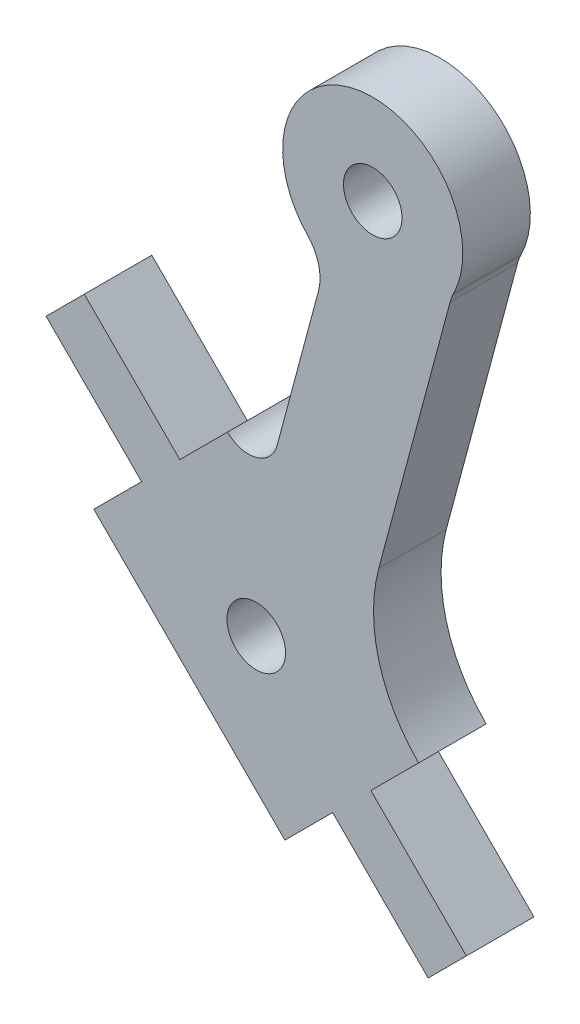
ISO-10303-21;
HEADER;
FILE_DESCRIPTION(('STEP AP214'),'2;1');
FILE_NAME('part.step','',(''),(''),'','','');
FILE_SCHEMA(('AUTOMOTIVE_DESIGN { 1 0 10303 214 1 1 1 1 }'));
ENDSEC;
DATA;
#1=APPLICATION_CONTEXT('core data for automotive mechanical design processes');
#2=APPLICATION_PROTOCOL_DEFINITION('international standard','automotive_design',2000,#1);
#3=PRODUCT_CONTEXT('',#1,'mechanical');
#4=PRODUCT('Part','Part','',(#3));
#5=PRODUCT_RELATED_PRODUCT_CATEGORY('part','',(#4));
#6=PRODUCT_DEFINITION_FORMATION('','',#4);
#7=PRODUCT_DEFINITION_CONTEXT('part definition',#1,'design');
#8=PRODUCT_DEFINITION('design','',#6,#7);
#9=PRODUCT_DEFINITION_SHAPE('','',#8);
#10=(LENGTH_UNIT() NAMED_UNIT(*) SI_UNIT(.MILLI.,.METRE.));
#11=(NAMED_UNIT(*) PLANE_ANGLE_UNIT() SI_UNIT($,.RADIAN.));
#12=(NAMED_UNIT(*) SI_UNIT($,.STERADIAN.) SOLID_ANGLE_UNIT());
#13=UNCERTAINTY_MEASURE_WITH_UNIT(LENGTH_MEASURE(1.E-05),#10,'distance_accuracy_value','');
#14=(GEOMETRIC_REPRESENTATION_CONTEXT(3) GLOBAL_UNCERTAINTY_ASSIGNED_CONTEXT((#13)) GLOBAL_UNIT_ASSIGNED_CONTEXT((#10,
#11,#12)) REPRESENTATION_CONTEXT('',''));
#15=CARTESIAN_POINT('',(0.,0.,0.));
#16=DIRECTION('',(0.,0.,1.));
#17=DIRECTION('',(1.,0.,0.));
#18=AXIS2_PLACEMENT_3D('',#15,#16,#17);
#19=CARTESIAN_POINT('',(59.9340954892964,47.2649253992922,3.));
#20=DIRECTION('',(0.,0.,1.));
#21=DIRECTION('',(1.,0.,0.));
#22=AXIS2_PLACEMENT_3D('',#19,#20,#21);
#23=PLANE('',#22);
#24=CARTESIAN_POINT('',(49.3883299118209,30.6277000118687,3.));
#25=DIRECTION('',(0.,0.,1.));
#26=DIRECTION('',(1.,0.,0.));
#27=AXIS2_PLACEMENT_3D('',#24,#25,#26);
#28=CIRCLE('',#27,1.30000000384585);
#29=CARTESIAN_POINT('',(50.6883299156668,30.6277000118687,3.));
#30=VERTEX_POINT('',#29);
#31=EDGE_CURVE('E194',#30,#30,#28,.T.);
#32=ORIENTED_EDGE('',*,*,#31,.F.);
#33=EDGE_LOOP('',(#32));
#34=FACE_BOUND('',#33,.T.);
#35=CARTESIAN_POINT('',(59.9340954892964,47.2649253992922,3.));
#36=DIRECTION('',(0.,0.,-1.));
#37=DIRECTION('',(1.,0.,0.));
#38=AXIS2_PLACEMENT_3D('',#35,#36,#37);
#39=CIRCLE('',#38,2.00302719153939);
#40=CARTESIAN_POINT('',(57.9994168196844,47.7837089528044,3.));
#41=VERTEX_POINT('',#40);
#42=CARTESIAN_POINT('',(58.1419902390858,48.1596190352445,3.));
#43=VERTEX_POINT('',#42);
#44=EDGE_CURVE('E225',#41,#43,#39,.T.);
#45=ORIENTED_EDGE('',*,*,#44,.T.);
#46=CARTESIAN_POINT('',(54.5632936656663,49.9465843957897,3.));
#47=DIRECTION('',(0.,0.,1.));
#48=DIRECTION('',(1.,0.,0.));
#49=AXIS2_PLACEMENT_3D('',#46,#47,#48);
#50=CIRCLE('',#49,4.00003929535607);
#51=CARTESIAN_POINT('',(51.6693591277227,47.1851613469814,3.));
#52=VERTEX_POINT('',#51);
#53=EDGE_CURVE('E123',#43,#52,#50,.T.);
#54=ORIENTED_EDGE('',*,*,#53,.T.);
#55=CARTESIAN_POINT('',(50.2224063067573,45.8043445908971,3.));
#56=DIRECTION('',(0.,0.,-1.));
#57=DIRECTION('',(1.,0.,0.));
#58=AXIS2_PLACEMENT_3D('',#55,#56,#57);
#59=CIRCLE('',#58,2.00008184332115);
#60=CARTESIAN_POINT('',(52.1543933570869,45.2868956394617,3.));
#61=VERTEX_POINT('',#60);
#62=EDGE_CURVE('E270',#52,#61,#59,.T.);
#63=ORIENTED_EDGE('',*,*,#62,.T.);
#64=DIRECTION('',(-0.258758623392047,-0.965942014212164,0.));
#65=VECTOR('',#64,1.);
#66=CARTESIAN_POINT('',(52.1543933570869,45.2868956394617,3.));
#67=LINE('',#66,#65);
#68=CARTESIAN_POINT('',(50.3176781770945,38.4304657464646,3.));
#69=VERTEX_POINT('',#68);
#70=EDGE_CURVE('E289',#61,#69,#67,.T.);
#71=ORIENTED_EDGE('',*,*,#70,.T.);
#72=CARTESIAN_POINT('',(49.0459421719349,38.7710877379477,3.));
#73=DIRECTION('',(0.,0.,-1.));
#74=DIRECTION('',(1.,0.,0.));
#75=AXIS2_PLACEMENT_3D('',#72,#73,#74);
#76=CIRCLE('',#75,1.31656211699297);
#77=CARTESIAN_POINT('',(48.1150199161977,37.8401099929537,3.));
#78=VERTEX_POINT('',#77);
#79=EDGE_CURVE('E286',#69,#78,#76,.T.);
#80=ORIENTED_EDGE('',*,*,#79,.T.);
#81=DIRECTION('',(-0.707040111425415,-0.707173444662295,0.));
#82=VECTOR('',#81,1.);
#83=CARTESIAN_POINT('',(45.9938699276881,35.7185599991413,3.));
#84=LINE('',#83,#82);
#85=CARTESIAN_POINT('',(45.9938699276881,35.7185599991413,3.));
#86=VERTEX_POINT('',#85);
#87=EDGE_CURVE('E288',#78,#86,#84,.T.);
#88=ORIENTED_EDGE('',*,*,#87,.T.);
#89=DIRECTION('',(-0.707156779603597,0.707056779233938,0.));
#90=VECTOR('',#89,1.);
#91=CARTESIAN_POINT('',(45.9938699276881,35.7185599991413,3.));
#92=LINE('',#91,#90);
#93=CARTESIAN_POINT('',(41.7508699329918,39.9609599832314,3.));
#94=VERTEX_POINT('',#93);
#95=EDGE_CURVE('E291',#86,#94,#92,.T.);
#96=ORIENTED_EDGE('',*,*,#95,.T.);
#97=DIRECTION('',(-0.707035944043609,-0.707177611233814,0.));
#98=VECTOR('',#97,1.);
#99=CARTESIAN_POINT('',(40.0539899407698,38.2637399910098,3.));
#100=LINE('',#99,#98);
#101=CARTESIAN_POINT('',(40.0539899407698,38.2637399910098,3.));
#102=VERTEX_POINT('',#101);
#103=EDGE_CURVE('E297',#94,#102,#100,.T.);
#104=ORIENTED_EDGE('',*,*,#103,.T.);
#105=DIRECTION('',(0.7071567796036,-0.707056779233935,0.));
#106=VECTOR('',#105,1.);
#107=CARTESIAN_POINT('',(44.2968899283951,34.0214399998484,3.));
#108=LINE('',#107,#106);
#109=CARTESIAN_POINT('',(44.2968899283951,34.0214399998484,3.));
#110=VERTEX_POINT('',#109);
#111=EDGE_CURVE('E299',#102,#110,#108,.T.);
#112=ORIENTED_EDGE('',*,*,#111,.T.);
#113=DIRECTION('',(-0.70705677923395,-0.707156779603585,0.));
#114=VECTOR('',#113,1.);
#115=CARTESIAN_POINT('',(44.2968899283951,34.0214399998484,3.));
#116=LINE('',#115,#114);
#117=CARTESIAN_POINT('',(42.1757399328144,31.8999900060357,3.));
#118=VERTEX_POINT('',#117);
#119=EDGE_CURVE('E301',#110,#118,#116,.T.);
#120=ORIENTED_EDGE('',*,*,#119,.T.);
#121=DIRECTION('',(0.707160945978746,-0.707052612244977,0.));
#122=VECTOR('',#121,1.);
#123=CARTESIAN_POINT('',(42.1757399328144,31.8999900060357,3.));
#124=LINE('',#123,#122);
#125=CARTESIAN_POINT('',(50.6616399080648,23.4153900307838,3.));
#126=VERTEX_POINT('',#125);
#127=EDGE_CURVE('E303',#118,#126,#124,.T.);
#128=ORIENTED_EDGE('',*,*,#127,.T.);
#129=DIRECTION('',(0.707073447435398,0.707140113366383,0.));
#130=VECTOR('',#129,1.);
#131=CARTESIAN_POINT('',(52.7827899107166,25.5367400245967,3.));
#132=LINE('',#131,#130);
#133=CARTESIAN_POINT('',(52.7827899107166,25.5367400245967,3.));
#134=VERTEX_POINT('',#133);
#135=EDGE_CURVE('E305',#126,#134,#132,.T.);
#136=ORIENTED_EDGE('',*,*,#135,.T.);
#137=DIRECTION('',(0.707156779603588,-0.707056779233947,0.));
#138=VECTOR('',#137,1.);
#139=CARTESIAN_POINT('',(57.025689898342,21.2944400334352,3.));
#140=LINE('',#139,#138);
#141=CARTESIAN_POINT('',(57.025689898342,21.2944400334352,3.));
#142=VERTEX_POINT('',#141);
#143=EDGE_CURVE('E307',#134,#142,#140,.T.);
#144=ORIENTED_EDGE('',*,*,#143,.T.);
#145=DIRECTION('',(0.707077613810516,0.707135947359507,0.));
#146=VECTOR('',#145,1.);
#147=CARTESIAN_POINT('',(57.025689898342,21.2944400334352,3.));
#148=LINE('',#147,#146);
#149=CARTESIAN_POINT('',(58.7226698976348,22.9915600327281,3.));
#150=VERTEX_POINT('',#149);
#151=EDGE_CURVE('E309',#142,#150,#148,.T.);
#152=ORIENTED_EDGE('',*,*,#151,.T.);
#153=DIRECTION('',(-0.70715677960359,0.707056779233945,0.));
#154=VECTOR('',#153,1.);
#155=CARTESIAN_POINT('',(58.7226698976348,22.9915600327281,3.));
#156=LINE('',#155,#154);
#157=CARTESIAN_POINT('',(54.4796699029387,27.2339600168183,3.));
#158=VERTEX_POINT('',#157);
#159=EDGE_CURVE('E172',#150,#158,#156,.T.);
#160=ORIENTED_EDGE('',*,*,#159,.T.);
#161=DIRECTION('',(0.707073446649667,0.70714011415204,0.));
#162=VECTOR('',#161,1.);
#163=CARTESIAN_POINT('',(54.4796699029387,27.2339600168183,3.));
#164=LINE('',#163,#162);
#165=CARTESIAN_POINT('',(56.6009198985191,29.355410017702,3.));
#166=VERTEX_POINT('',#165);
#167=EDGE_CURVE('E166',#158,#166,#164,.T.);
#168=ORIENTED_EDGE('',*,*,#167,.T.);
#169=CARTESIAN_POINT('',(61.4332448997318,34.1886346537737,3.));
#170=DIRECTION('',(0.,0.,-1.));
#171=DIRECTION('',(1.,0.,0.));
#172=AXIS2_PLACEMENT_3D('',#169,#170,#171);
#173=CIRCLE('',#172,6.83457572202365);
#174=CARTESIAN_POINT('',(54.8314530763904,35.9571849135452,3.));
#175=VERTEX_POINT('',#174);
#176=EDGE_CURVE('E170',#166,#175,#173,.T.);
#177=ORIENTED_EDGE('',*,*,#176,.T.);
#178=DIRECTION('',(0.25874712050464,0.965945095556967,0.));
#179=VECTOR('',#178,1.);
#180=CARTESIAN_POINT('',(57.9994168196844,47.7837089528044,3.));
#181=LINE('',#180,#179);
#182=EDGE_CURVE('E50',#175,#41,#181,.T.);
#183=ORIENTED_EDGE('',*,*,#182,.T.);
#184=EDGE_LOOP('',(#45,#54,#63,#71,#80,#88,#96,#104,#112,#120,#128,#136,#144,#152,#160,#168,
#177,#183));
#185=FACE_BOUND('',#184,.T.);
#186=CARTESIAN_POINT('',(54.5632638715183,49.9465659826852,3.));
#187=DIRECTION('',(0.,0.,1.));
#188=DIRECTION('',(1.,0.,0.));
#189=AXIS2_PLACEMENT_3D('',#186,#187,#188);
#190=CIRCLE('',#189,1.30000000192318);
#191=CARTESIAN_POINT('',(55.8632638734414,49.9465659826852,3.));
#192=VERTEX_POINT('',#191);
#193=EDGE_CURVE('E351',#192,#192,#190,.T.);
#194=ORIENTED_EDGE('',*,*,#193,.F.);
#195=EDGE_LOOP('',(#194));
#196=FACE_BOUND('',#195,.T.);
#197=ADVANCED_FACE('F33',(#34,#185,#196),#23,.T.);
#198=CARTESIAN_POINT('',(59.9340954892964,47.2649253992922,0.));
#199=DIRECTION('',(0.,0.,1.));
#200=DIRECTION('',(1.,0.,0.));
#201=AXIS2_PLACEMENT_3D('',#198,#199,#200);
#202=PLANE('',#201);
#203=CARTESIAN_POINT('',(59.9340954892964,47.2649253992922,0.));
#204=DIRECTION('',(0.,0.,-1.));
#205=DIRECTION('',(1.,0.,0.));
#206=AXIS2_PLACEMENT_3D('',#203,#204,#205);
#207=CIRCLE('',#206,2.00302719153939);
#208=CARTESIAN_POINT('',(57.9994168196844,47.7837089528044,0.));
#209=VERTEX_POINT('',#208);
#210=CARTESIAN_POINT('',(58.1419902390858,48.1596190352445,0.));
#211=VERTEX_POINT('',#210);
#212=EDGE_CURVE('E190',#209,#211,#207,.T.);
#213=ORIENTED_EDGE('',*,*,#212,.F.);
#214=DIRECTION('',(0.25874712050464,0.965945095556967,0.));
#215=VECTOR('',#214,1.);
#216=CARTESIAN_POINT('',(57.9994168196844,47.7837089528044,0.));
#217=LINE('',#216,#215);
#218=CARTESIAN_POINT('',(54.8314530763904,35.9571849135452,0.));
#219=VERTEX_POINT('',#218);
#220=EDGE_CURVE('E115',#219,#209,#217,.T.);
#221=ORIENTED_EDGE('',*,*,#220,.F.);
#222=CARTESIAN_POINT('',(61.4332448997318,34.1886346537737,0.));
#223=DIRECTION('',(0.,0.,-1.));
#224=DIRECTION('',(1.,0.,0.));
#225=AXIS2_PLACEMENT_3D('',#222,#223,#224);
#226=CIRCLE('',#225,6.83457572202365);
#227=CARTESIAN_POINT('',(56.6009198985191,29.355410017702,0.));
#228=VERTEX_POINT('',#227);
#229=EDGE_CURVE('E109',#228,#219,#226,.T.);
#230=ORIENTED_EDGE('',*,*,#229,.F.);
#231=DIRECTION('',(0.707073446649667,0.70714011415204,0.));
#232=VECTOR('',#231,1.);
#233=CARTESIAN_POINT('',(54.4796699029387,27.2339600168183,0.));
#234=LINE('',#233,#232);
#235=CARTESIAN_POINT('',(54.4796699029387,27.2339600168183,0.));
#236=VERTEX_POINT('',#235);
#237=EDGE_CURVE('E180',#236,#228,#234,.T.);
#238=ORIENTED_EDGE('',*,*,#237,.F.);
#239=DIRECTION('',(-0.70715677960359,0.707056779233945,0.));
#240=VECTOR('',#239,1.);
#241=CARTESIAN_POINT('',(58.7226698976348,22.9915600327281,0.));
#242=LINE('',#241,#240);
#243=CARTESIAN_POINT('',(58.7226698976348,22.9915600327281,0.));
#244=VERTEX_POINT('',#243);
#245=EDGE_CURVE('E220',#244,#236,#242,.T.);
#246=ORIENTED_EDGE('',*,*,#245,.F.);
#247=DIRECTION('',(0.707077613810516,0.707135947359507,0.));
#248=VECTOR('',#247,1.);
#249=CARTESIAN_POINT('',(57.025689898342,21.2944400334352,0.));
#250=LINE('',#249,#248);
#251=CARTESIAN_POINT('',(57.025689898342,21.2944400334352,0.));
#252=VERTEX_POINT('',#251);
#253=EDGE_CURVE('E218',#252,#244,#250,.T.);
#254=ORIENTED_EDGE('',*,*,#253,.F.);
#255=DIRECTION('',(0.707156779603588,-0.707056779233947,0.));
#256=VECTOR('',#255,1.);
#257=CARTESIAN_POINT('',(57.025689898342,21.2944400334352,0.));
#258=LINE('',#257,#256);
#259=CARTESIAN_POINT('',(52.7827899107166,25.5367400245967,0.));
#260=VERTEX_POINT('',#259);
#261=EDGE_CURVE('E216',#260,#252,#258,.T.);
#262=ORIENTED_EDGE('',*,*,#261,.F.);
#263=DIRECTION('',(0.707073447435398,0.707140113366383,0.));
#264=VECTOR('',#263,1.);
#265=CARTESIAN_POINT('',(52.7827899107166,25.5367400245967,0.));
#266=LINE('',#265,#264);
#267=CARTESIAN_POINT('',(50.6616399080648,23.4153900307838,0.));
#268=VERTEX_POINT('',#267);
#269=EDGE_CURVE('E214',#268,#260,#266,.T.);
#270=ORIENTED_EDGE('',*,*,#269,.F.);
#271=DIRECTION('',(0.707160945978746,-0.707052612244977,0.));
#272=VECTOR('',#271,1.);
#273=CARTESIAN_POINT('',(42.1757399328144,31.8999900060357,0.));
#274=LINE('',#273,#272);
#275=CARTESIAN_POINT('',(42.1757399328144,31.8999900060357,0.));
#276=VERTEX_POINT('',#275);
#277=EDGE_CURVE('E212',#276,#268,#274,.T.);
#278=ORIENTED_EDGE('',*,*,#277,.F.);
#279=DIRECTION('',(-0.70705677923395,-0.707156779603585,0.));
#280=VECTOR('',#279,1.);
#281=CARTESIAN_POINT('',(44.2968899283951,34.0214399998484,0.));
#282=LINE('',#281,#280);
#283=CARTESIAN_POINT('',(44.2968899283951,34.0214399998484,0.));
#284=VERTEX_POINT('',#283);
#285=EDGE_CURVE('E210',#284,#276,#282,.T.);
#286=ORIENTED_EDGE('',*,*,#285,.F.);
#287=DIRECTION('',(0.7071567796036,-0.707056779233935,0.));
#288=VECTOR('',#287,1.);
#289=CARTESIAN_POINT('',(44.2968899283951,34.0214399998484,0.));
#290=LINE('',#289,#288);
#291=CARTESIAN_POINT('',(40.0539899407698,38.2637399910098,0.));
#292=VERTEX_POINT('',#291);
#293=EDGE_CURVE('E208',#292,#284,#290,.T.);
#294=ORIENTED_EDGE('',*,*,#293,.F.);
#295=DIRECTION('',(-0.707035944043609,-0.707177611233814,0.));
#296=VECTOR('',#295,1.);
#297=CARTESIAN_POINT('',(40.0539899407698,38.2637399910098,0.));
#298=LINE('',#297,#296);
#299=CARTESIAN_POINT('',(41.7508699329918,39.9609599832314,0.));
#300=VERTEX_POINT('',#299);
#301=EDGE_CURVE('E206',#300,#292,#298,.T.);
#302=ORIENTED_EDGE('',*,*,#301,.F.);
#303=DIRECTION('',(-0.707156779603597,0.707056779233938,0.));
#304=VECTOR('',#303,1.);
#305=CARTESIAN_POINT('',(45.9938699276881,35.7185599991413,0.));
#306=LINE('',#305,#304);
#307=CARTESIAN_POINT('',(45.9938699276881,35.7185599991413,0.));
#308=VERTEX_POINT('',#307);
#309=EDGE_CURVE('E204',#308,#300,#306,.T.);
#310=ORIENTED_EDGE('',*,*,#309,.F.);
#311=DIRECTION('',(-0.707040111425415,-0.707173444662295,0.));
#312=VECTOR('',#311,1.);
#313=CARTESIAN_POINT('',(45.9938699276881,35.7185599991413,0.));
#314=LINE('',#313,#312);
#315=CARTESIAN_POINT('',(48.1150199161977,37.8401099929537,0.));
#316=VERTEX_POINT('',#315);
#317=EDGE_CURVE('E202',#316,#308,#314,.T.);
#318=ORIENTED_EDGE('',*,*,#317,.F.);
#319=CARTESIAN_POINT('',(49.0459421719349,38.7710877379477,0.));
#320=DIRECTION('',(0.,0.,-1.));
#321=DIRECTION('',(1.,0.,0.));
#322=AXIS2_PLACEMENT_3D('',#319,#320,#321);
#323=CIRCLE('',#322,1.31656211699297);
#324=CARTESIAN_POINT('',(50.3176781770945,38.4304657464646,0.));
#325=VERTEX_POINT('',#324);
#326=EDGE_CURVE('E200',#325,#316,#323,.T.);
#327=ORIENTED_EDGE('',*,*,#326,.F.);
#328=DIRECTION('',(-0.258758623392047,-0.965942014212164,0.));
#329=VECTOR('',#328,1.);
#330=CARTESIAN_POINT('',(52.1543933570869,45.2868956394617,0.));
#331=LINE('',#330,#329);
#332=CARTESIAN_POINT('',(52.1543933570869,45.2868956394617,0.));
#333=VERTEX_POINT('',#332);
#334=EDGE_CURVE('E198',#333,#325,#331,.T.);
#335=ORIENTED_EDGE('',*,*,#334,.F.);
#336=CARTESIAN_POINT('',(50.2224063067573,45.8043445908971,0.));
#337=DIRECTION('',(0.,0.,-1.));
#338=DIRECTION('',(1.,0.,0.));
#339=AXIS2_PLACEMENT_3D('',#336,#337,#338);
#340=CIRCLE('',#339,2.00008184332115);
#341=CARTESIAN_POINT('',(51.6693591277227,47.1851613469814,0.));
#342=VERTEX_POINT('',#341);
#343=EDGE_CURVE('E196',#342,#333,#340,.T.);
#344=ORIENTED_EDGE('',*,*,#343,.F.);
#345=CARTESIAN_POINT('',(54.5632936656663,49.9465843957897,0.));
#346=DIRECTION('',(0.,0.,1.));
#347=DIRECTION('',(1.,0.,0.));
#348=AXIS2_PLACEMENT_3D('',#345,#346,#347);
#349=CIRCLE('',#348,4.00003929535607);
#350=EDGE_CURVE('E193',#211,#342,#349,.T.);
#351=ORIENTED_EDGE('',*,*,#350,.F.);
#352=EDGE_LOOP('',(#213,#221,#230,#238,#246,#254,#262,#270,#278,#286,#294,#302,#310,#318,#327,
#335,#344,#351));
#353=FACE_BOUND('',#352,.T.);
#354=CARTESIAN_POINT('',(49.3883299118209,30.6277000118687,0.));
#355=DIRECTION('',(0.,0.,1.));
#356=DIRECTION('',(1.,0.,0.));
#357=AXIS2_PLACEMENT_3D('',#354,#355,#356);
#358=CIRCLE('',#357,1.30000000384585);
#359=CARTESIAN_POINT('',(50.6883299156668,30.6277000118687,0.));
#360=VERTEX_POINT('',#359);
#361=EDGE_CURVE('E357',#360,#360,#358,.T.);
#362=ORIENTED_EDGE('',*,*,#361,.T.);
#363=EDGE_LOOP('',(#362));
#364=FACE_BOUND('',#363,.T.);
#365=CARTESIAN_POINT('',(54.5632638715183,49.9465659826852,0.));
#366=DIRECTION('',(0.,0.,1.));
#367=DIRECTION('',(1.,0.,0.));
#368=AXIS2_PLACEMENT_3D('',#365,#366,#367);
#369=CIRCLE('',#368,1.30000000192318);
#370=CARTESIAN_POINT('',(55.8632638734414,49.9465659826852,0.));
#371=VERTEX_POINT('',#370);
#372=EDGE_CURVE('E354',#371,#371,#369,.T.);
#373=ORIENTED_EDGE('',*,*,#372,.T.);
#374=EDGE_LOOP('',(#373));
#375=FACE_BOUND('',#374,.T.);
#376=ADVANCED_FACE('F274',(#353,#364,#375),#202,.F.);
#377=CARTESIAN_POINT('',(59.9340954892964,47.2649253992922,3.));
#378=DIRECTION('',(0.,0.,-1.));
#379=DIRECTION('',(-1.,0.,0.));
#380=AXIS2_PLACEMENT_3D('',#377,#378,#379);
#381=CYLINDRICAL_SURFACE('',#380,2.00302719153939);
#382=ORIENTED_EDGE('',*,*,#212,.T.);
#383=DIRECTION('',(0.,0.,-1.));
#384=VECTOR('',#383,1.);
#385=CARTESIAN_POINT('',(58.1419902390858,48.1596190352445,3.));
#386=LINE('',#385,#384);
#387=EDGE_CURVE('E11',#43,#211,#386,.T.);
#388=ORIENTED_EDGE('',*,*,#387,.F.);
#389=ORIENTED_EDGE('',*,*,#44,.F.);
#390=DIRECTION('',(0.,0.,-1.));
#391=VECTOR('',#390,1.);
#392=CARTESIAN_POINT('',(57.9994168196844,47.7837089528044,3.));
#393=LINE('',#392,#391);
#394=EDGE_CURVE('E186',#41,#209,#393,.T.);
#395=ORIENTED_EDGE('',*,*,#394,.T.);
#396=EDGE_LOOP('',(#382,#388,#389,#395));
#397=FACE_BOUND('',#396,.T.);
#398=ADVANCED_FACE('F35',(#397),#381,.F.);
#399=CARTESIAN_POINT('',(54.5632936656663,49.9465843957897,3.));
#400=DIRECTION('',(0.,0.,-1.));
#401=DIRECTION('',(-1.,0.,0.));
#402=AXIS2_PLACEMENT_3D('',#399,#400,#401);
#403=CYLINDRICAL_SURFACE('',#402,4.00003929535607);
#404=ORIENTED_EDGE('',*,*,#350,.T.);
#405=DIRECTION('',(0.,0.,-1.));
#406=VECTOR('',#405,1.);
#407=CARTESIAN_POINT('',(51.6693591277227,47.1851613469814,3.));
#408=LINE('',#407,#406);
#409=EDGE_CURVE('E42',#52,#342,#408,.T.);
#410=ORIENTED_EDGE('',*,*,#409,.F.);
#411=ORIENTED_EDGE('',*,*,#53,.F.);
#412=ORIENTED_EDGE('',*,*,#387,.T.);
#413=EDGE_LOOP('',(#404,#410,#411,#412));
#414=FACE_BOUND('',#413,.T.);
#415=ADVANCED_FACE('F510',(#414),#403,.T.);
#416=CARTESIAN_POINT('',(50.2224063067573,45.8043445908971,3.));
#417=DIRECTION('',(0.,0.,-1.));
#418=DIRECTION('',(-1.,0.,0.));
#419=AXIS2_PLACEMENT_3D('',#416,#417,#418);
#420=CYLINDRICAL_SURFACE('',#419,2.00008184332115);
#421=ORIENTED_EDGE('',*,*,#343,.T.);
#422=DIRECTION('',(0.,0.,-1.));
#423=VECTOR('',#422,1.);
#424=CARTESIAN_POINT('',(52.1543933570869,45.2868956394617,3.));
#425=LINE('',#424,#423);
#426=EDGE_CURVE('E262',#61,#333,#425,.T.);
#427=ORIENTED_EDGE('',*,*,#426,.F.);
#428=ORIENTED_EDGE('',*,*,#62,.F.);
#429=ORIENTED_EDGE('',*,*,#409,.T.);
#430=EDGE_LOOP('',(#421,#427,#428,#429));
#431=FACE_BOUND('',#430,.T.);
#432=ADVANCED_FACE('F268',(#431),#420,.F.);
#433=CARTESIAN_POINT('',(52.1543933570869,45.2868956394617,3.));
#434=DIRECTION('',(0.965942014212164,-0.258758623392047,0.));
#435=DIRECTION('',(0.258758623392047,0.965942014212164,0.));
#436=AXIS2_PLACEMENT_3D('',#433,#434,#435);
#437=PLANE('',#436);
#438=ORIENTED_EDGE('',*,*,#334,.T.);
#439=DIRECTION('',(0.,0.,-1.));
#440=VECTOR('',#439,1.);
#441=CARTESIAN_POINT('',(50.3176781770945,38.4304657464646,3.));
#442=LINE('',#441,#440);
#443=EDGE_CURVE('E259',#69,#325,#442,.T.);
#444=ORIENTED_EDGE('',*,*,#443,.F.);
#445=ORIENTED_EDGE('',*,*,#70,.F.);
#446=ORIENTED_EDGE('',*,*,#426,.T.);
#447=EDGE_LOOP('',(#438,#444,#445,#446));
#448=FACE_BOUND('',#447,.T.);
#449=ADVANCED_FACE('F280',(#448),#437,.F.);
#450=CARTESIAN_POINT('',(49.0459421719349,38.7710877379477,3.));
#451=DIRECTION('',(0.,0.,-1.));
#452=DIRECTION('',(-1.,0.,0.));
#453=AXIS2_PLACEMENT_3D('',#450,#451,#452);
#454=CYLINDRICAL_SURFACE('',#453,1.31656211699297);
#455=ORIENTED_EDGE('',*,*,#326,.T.);
#456=DIRECTION('',(0.,0.,-1.));
#457=VECTOR('',#456,1.);
#458=CARTESIAN_POINT('',(48.1150199161977,37.8401099929537,3.));
#459=LINE('',#458,#457);
#460=EDGE_CURVE('E256',#78,#316,#459,.T.);
#461=ORIENTED_EDGE('',*,*,#460,.F.);
#462=ORIENTED_EDGE('',*,*,#79,.F.);
#463=ORIENTED_EDGE('',*,*,#443,.T.);
#464=EDGE_LOOP('',(#455,#461,#462,#463));
#465=FACE_BOUND('',#464,.T.);
#466=ADVANCED_FACE('F284',(#465),#454,.F.);
#467=CARTESIAN_POINT('',(45.9938699276881,35.7185599991413,3.));
#468=DIRECTION('',(0.707173444662295,-0.707040111425415,0.));
#469=DIRECTION('',(0.707040111425415,0.707173444662295,0.));
#470=AXIS2_PLACEMENT_3D('',#467,#468,#469);
#471=PLANE('',#470);
#472=ORIENTED_EDGE('',*,*,#317,.T.);
#473=DIRECTION('',(0.,0.,-1.));
#474=VECTOR('',#473,1.);
#475=CARTESIAN_POINT('',(45.9938699276881,35.7185599991413,3.));
#476=LINE('',#475,#474);
#477=EDGE_CURVE('E253',#86,#308,#476,.T.);
#478=ORIENTED_EDGE('',*,*,#477,.F.);
#479=ORIENTED_EDGE('',*,*,#87,.F.);
#480=ORIENTED_EDGE('',*,*,#460,.T.);
#481=EDGE_LOOP('',(#472,#478,#479,#480));
#482=FACE_BOUND('',#481,.T.);
#483=ADVANCED_FACE('F475',(#482),#471,.F.);
#484=CARTESIAN_POINT('',(45.9938699276881,35.7185599991413,3.));
#485=DIRECTION('',(-0.707056779233938,-0.707156779603597,0.));
#486=DIRECTION('',(0.707156779603597,-0.707056779233938,0.));
#487=AXIS2_PLACEMENT_3D('',#484,#485,#486);
#488=PLANE('',#487);
#489=ORIENTED_EDGE('',*,*,#309,.T.);
#490=DIRECTION('',(0.,0.,-1.));
#491=VECTOR('',#490,1.);
#492=CARTESIAN_POINT('',(41.7508699329918,39.9609599832314,3.));
#493=LINE('',#492,#491);
#494=EDGE_CURVE('E250',#94,#300,#493,.T.);
#495=ORIENTED_EDGE('',*,*,#494,.F.);
#496=ORIENTED_EDGE('',*,*,#95,.F.);
#497=ORIENTED_EDGE('',*,*,#477,.T.);
#498=EDGE_LOOP('',(#489,#495,#496,#497));
#499=FACE_BOUND('',#498,.T.);
#500=ADVANCED_FACE('F465',(#499),#488,.F.);
#501=CARTESIAN_POINT('',(40.0539899407698,38.2637399910098,3.));
#502=DIRECTION('',(0.707177611233814,-0.707035944043609,0.));
#503=DIRECTION('',(0.707035944043609,0.707177611233814,0.));
#504=AXIS2_PLACEMENT_3D('',#501,#502,#503);
#505=PLANE('',#504);
#506=ORIENTED_EDGE('',*,*,#301,.T.);
#507=DIRECTION('',(0.,0.,-1.));
#508=VECTOR('',#507,1.);
#509=CARTESIAN_POINT('',(40.0539899407698,38.2637399910098,3.));
#510=LINE('',#509,#508);
#511=EDGE_CURVE('E247',#102,#292,#510,.T.);
#512=ORIENTED_EDGE('',*,*,#511,.F.);
#513=ORIENTED_EDGE('',*,*,#103,.F.);
#514=ORIENTED_EDGE('',*,*,#494,.T.);
#515=EDGE_LOOP('',(#506,#512,#513,#514));
#516=FACE_BOUND('',#515,.T.);
#517=ADVANCED_FACE('F455',(#516),#505,.F.);
#518=CARTESIAN_POINT('',(44.2968899283951,34.0214399998484,3.));
#519=DIRECTION('',(0.707056779233935,0.7071567796036,0.));
#520=DIRECTION('',(-0.7071567796036,0.707056779233935,0.));
#521=AXIS2_PLACEMENT_3D('',#518,#519,#520);
#522=PLANE('',#521);
#523=ORIENTED_EDGE('',*,*,#293,.T.);
#524=DIRECTION('',(0.,0.,-1.));
#525=VECTOR('',#524,1.);
#526=CARTESIAN_POINT('',(44.2968899283951,34.0214399998484,3.));
#527=LINE('',#526,#525);
#528=EDGE_CURVE('E244',#110,#284,#527,.T.);
#529=ORIENTED_EDGE('',*,*,#528,.F.);
#530=ORIENTED_EDGE('',*,*,#111,.F.);
#531=ORIENTED_EDGE('',*,*,#511,.T.);
#532=EDGE_LOOP('',(#523,#529,#530,#531));
#533=FACE_BOUND('',#532,.T.);
#534=ADVANCED_FACE('F445',(#533),#522,.F.);
#535=CARTESIAN_POINT('',(44.2968899283951,34.0214399998484,3.));
#536=DIRECTION('',(0.707156779603585,-0.70705677923395,0.));
#537=DIRECTION('',(0.70705677923395,0.707156779603585,0.));
#538=AXIS2_PLACEMENT_3D('',#535,#536,#537);
#539=PLANE('',#538);
#540=ORIENTED_EDGE('',*,*,#285,.T.);
#541=DIRECTION('',(0.,0.,-1.));
#542=VECTOR('',#541,1.);
#543=CARTESIAN_POINT('',(42.1757399328144,31.8999900060357,3.));
#544=LINE('',#543,#542);
#545=EDGE_CURVE('E241',#118,#276,#544,.T.);
#546=ORIENTED_EDGE('',*,*,#545,.F.);
#547=ORIENTED_EDGE('',*,*,#119,.F.);
#548=ORIENTED_EDGE('',*,*,#528,.T.);
#549=EDGE_LOOP('',(#540,#546,#547,#548));
#550=FACE_BOUND('',#549,.T.);
#551=ADVANCED_FACE('F435',(#550),#539,.F.);
#552=CARTESIAN_POINT('',(42.1757399328144,31.8999900060357,3.));
#553=DIRECTION('',(0.707052612244977,0.707160945978746,0.));
#554=DIRECTION('',(-0.707160945978746,0.707052612244977,0.));
#555=AXIS2_PLACEMENT_3D('',#552,#553,#554);
#556=PLANE('',#555);
#557=ORIENTED_EDGE('',*,*,#277,.T.);
#558=DIRECTION('',(0.,0.,-1.));
#559=VECTOR('',#558,1.);
#560=CARTESIAN_POINT('',(50.6616399080648,23.4153900307838,3.));
#561=LINE('',#560,#559);
#562=EDGE_CURVE('E238',#126,#268,#561,.T.);
#563=ORIENTED_EDGE('',*,*,#562,.F.);
#564=ORIENTED_EDGE('',*,*,#127,.F.);
#565=ORIENTED_EDGE('',*,*,#545,.T.);
#566=EDGE_LOOP('',(#557,#563,#564,#565));
#567=FACE_BOUND('',#566,.T.);
#568=ADVANCED_FACE('F425',(#567),#556,.F.);
#569=CARTESIAN_POINT('',(52.7827899107166,25.5367400245967,3.));
#570=DIRECTION('',(-0.707140113366383,0.707073447435398,0.));
#571=DIRECTION('',(-0.707073447435398,-0.707140113366383,0.));
#572=AXIS2_PLACEMENT_3D('',#569,#570,#571);
#573=PLANE('',#572);
#574=ORIENTED_EDGE('',*,*,#269,.T.);
#575=DIRECTION('',(0.,0.,-1.));
#576=VECTOR('',#575,1.);
#577=CARTESIAN_POINT('',(52.7827899107166,25.5367400245967,3.));
#578=LINE('',#577,#576);
#579=EDGE_CURVE('E235',#134,#260,#578,.T.);
#580=ORIENTED_EDGE('',*,*,#579,.F.);
#581=ORIENTED_EDGE('',*,*,#135,.F.);
#582=ORIENTED_EDGE('',*,*,#562,.T.);
#583=EDGE_LOOP('',(#574,#580,#581,#582));
#584=FACE_BOUND('',#583,.T.);
#585=ADVANCED_FACE('F415',(#584),#573,.F.);
#586=CARTESIAN_POINT('',(57.025689898342,21.2944400334352,3.));
#587=DIRECTION('',(0.707056779233947,0.707156779603588,0.));
#588=DIRECTION('',(-0.707156779603588,0.707056779233947,0.));
#589=AXIS2_PLACEMENT_3D('',#586,#587,#588);
#590=PLANE('',#589);
#591=ORIENTED_EDGE('',*,*,#261,.T.);
#592=DIRECTION('',(0.,0.,-1.));
#593=VECTOR('',#592,1.);
#594=CARTESIAN_POINT('',(57.025689898342,21.2944400334352,3.));
#595=LINE('',#594,#593);
#596=EDGE_CURVE('E232',#142,#252,#595,.T.);
#597=ORIENTED_EDGE('',*,*,#596,.F.);
#598=ORIENTED_EDGE('',*,*,#143,.F.);
#599=ORIENTED_EDGE('',*,*,#579,.T.);
#600=EDGE_LOOP('',(#591,#597,#598,#599));
#601=FACE_BOUND('',#600,.T.);
#602=ADVANCED_FACE('F406',(#601),#590,.F.);
#603=CARTESIAN_POINT('',(57.025689898342,21.2944400334352,3.));
#604=DIRECTION('',(-0.707135947359507,0.707077613810516,0.));
#605=DIRECTION('',(-0.707077613810516,-0.707135947359507,0.));
#606=AXIS2_PLACEMENT_3D('',#603,#604,#605);
#607=PLANE('',#606);
#608=ORIENTED_EDGE('',*,*,#253,.T.);
#609=DIRECTION('',(0.,0.,-1.));
#610=VECTOR('',#609,1.);
#611=CARTESIAN_POINT('',(58.7226698976348,22.9915600327281,3.));
#612=LINE('',#611,#610);
#613=EDGE_CURVE('E229',#150,#244,#612,.T.);
#614=ORIENTED_EDGE('',*,*,#613,.F.);
#615=ORIENTED_EDGE('',*,*,#151,.F.);
#616=ORIENTED_EDGE('',*,*,#596,.T.);
#617=EDGE_LOOP('',(#608,#614,#615,#616));
#618=FACE_BOUND('',#617,.T.);
#619=ADVANCED_FACE('F315',(#618),#607,.F.);
#620=CARTESIAN_POINT('',(58.7226698976348,22.9915600327281,3.));
#621=DIRECTION('',(-0.707056779233945,-0.70715677960359,0.));
#622=DIRECTION('',(0.70715677960359,-0.707056779233945,0.));
#623=AXIS2_PLACEMENT_3D('',#620,#621,#622);
#624=PLANE('',#623);
#625=ORIENTED_EDGE('',*,*,#245,.T.);
#626=DIRECTION('',(0.,0.,-1.));
#627=VECTOR('',#626,1.);
#628=CARTESIAN_POINT('',(54.4796699029387,27.2339600168183,3.));
#629=LINE('',#628,#627);
#630=EDGE_CURVE('E181',#158,#236,#629,.T.);
#631=ORIENTED_EDGE('',*,*,#630,.F.);
#632=ORIENTED_EDGE('',*,*,#159,.F.);
#633=ORIENTED_EDGE('',*,*,#613,.T.);
#634=EDGE_LOOP('',(#625,#631,#632,#633));
#635=FACE_BOUND('',#634,.T.);
#636=ADVANCED_FACE('F319',(#635),#624,.F.);
#637=CARTESIAN_POINT('',(54.4796699029387,27.2339600168183,3.));
#638=DIRECTION('',(-0.70714011415204,0.707073446649667,0.));
#639=DIRECTION('',(-0.707073446649667,-0.70714011415204,0.));
#640=AXIS2_PLACEMENT_3D('',#637,#638,#639);
#641=PLANE('',#640);
#642=ORIENTED_EDGE('',*,*,#237,.T.);
#643=DIRECTION('',(0.,0.,-1.));
#644=VECTOR('',#643,1.);
#645=CARTESIAN_POINT('',(56.6009198985191,29.355410017702,3.));
#646=LINE('',#645,#644);
#647=EDGE_CURVE('E177',#166,#228,#646,.T.);
#648=ORIENTED_EDGE('',*,*,#647,.F.);
#649=ORIENTED_EDGE('',*,*,#167,.F.);
#650=ORIENTED_EDGE('',*,*,#630,.T.);
#651=EDGE_LOOP('',(#642,#648,#649,#650));
#652=FACE_BOUND('',#651,.T.);
#653=ADVANCED_FACE('F178',(#652),#641,.F.);
#654=CARTESIAN_POINT('',(61.4332448997318,34.1886346537737,3.));
#655=DIRECTION('',(0.,0.,-1.));
#656=DIRECTION('',(-1.,0.,0.));
#657=AXIS2_PLACEMENT_3D('',#654,#655,#656);
#658=CYLINDRICAL_SURFACE('',#657,6.83457572202365);
#659=ORIENTED_EDGE('',*,*,#229,.T.);
#660=DIRECTION('',(0.,0.,-1.));
#661=VECTOR('',#660,1.);
#662=CARTESIAN_POINT('',(54.8314530763904,35.9571849135452,3.));
#663=LINE('',#662,#661);
#664=EDGE_CURVE('E182',#175,#219,#663,.T.);
#665=ORIENTED_EDGE('',*,*,#664,.F.);
#666=ORIENTED_EDGE('',*,*,#176,.F.);
#667=ORIENTED_EDGE('',*,*,#647,.T.);
#668=EDGE_LOOP('',(#659,#665,#666,#667));
#669=FACE_BOUND('',#668,.T.);
#670=ADVANCED_FACE('F184',(#669),#658,.F.);
#671=CARTESIAN_POINT('',(57.9994168196844,47.7837089528044,3.));
#672=DIRECTION('',(-0.965945095556967,0.25874712050464,0.));
#673=DIRECTION('',(-0.25874712050464,-0.965945095556967,0.));
#674=AXIS2_PLACEMENT_3D('',#671,#672,#673);
#675=PLANE('',#674);
#676=ORIENTED_EDGE('',*,*,#220,.T.);
#677=ORIENTED_EDGE('',*,*,#394,.F.);
#678=ORIENTED_EDGE('',*,*,#182,.F.);
#679=ORIENTED_EDGE('',*,*,#664,.T.);
#680=EDGE_LOOP('',(#676,#677,#678,#679));
#681=FACE_BOUND('',#680,.T.);
#682=ADVANCED_FACE('F323',(#681),#675,.F.);
#683=CARTESIAN_POINT('',(49.3883299118209,30.6277000118687,3.));
#684=DIRECTION('',(0.,0.,-1.));
#685=DIRECTION('',(-1.,0.,0.));
#686=AXIS2_PLACEMENT_3D('',#683,#684,#685);
#687=CYLINDRICAL_SURFACE('',#686,1.30000000384585);
#688=ORIENTED_EDGE('',*,*,#31,.T.);
#689=EDGE_LOOP('',(#688));
#690=FACE_BOUND('',#689,.T.);
#691=ORIENTED_EDGE('',*,*,#361,.F.);
#692=EDGE_LOOP('',(#691));
#693=FACE_BOUND('',#692,.T.);
#694=ADVANCED_FACE('F325',(#690,#693),#687,.F.);
#695=CARTESIAN_POINT('',(54.5632638715183,49.9465659826852,3.));
#696=DIRECTION('',(0.,0.,-1.));
#697=DIRECTION('',(-1.,0.,0.));
#698=AXIS2_PLACEMENT_3D('',#695,#696,#697);
#699=CYLINDRICAL_SURFACE('',#698,1.30000000192318);
#700=ORIENTED_EDGE('',*,*,#193,.T.);
#701=EDGE_LOOP('',(#700));
#702=FACE_BOUND('',#701,.T.);
#703=ORIENTED_EDGE('',*,*,#372,.F.);
#704=EDGE_LOOP('',(#703));
#705=FACE_BOUND('',#704,.T.);
#706=ADVANCED_FACE('F331',(#702,#705),#699,.F.);
#707=CLOSED_SHELL('',(#197,#376,#398,#415,#432,#449,#466,#483,#500,#517,#534,#551,#568,#585,
#602,#619,#636,#653,#670,#682,#694,#706));
#708=MANIFOLD_SOLID_BREP('B2',#707);
#709=ADVANCED_BREP_SHAPE_REPRESENTATION('',(#18,#708),#14);
#710=SHAPE_DEFINITION_REPRESENTATION(#9,#709);
ENDSEC;
END-ISO-10303-21;
